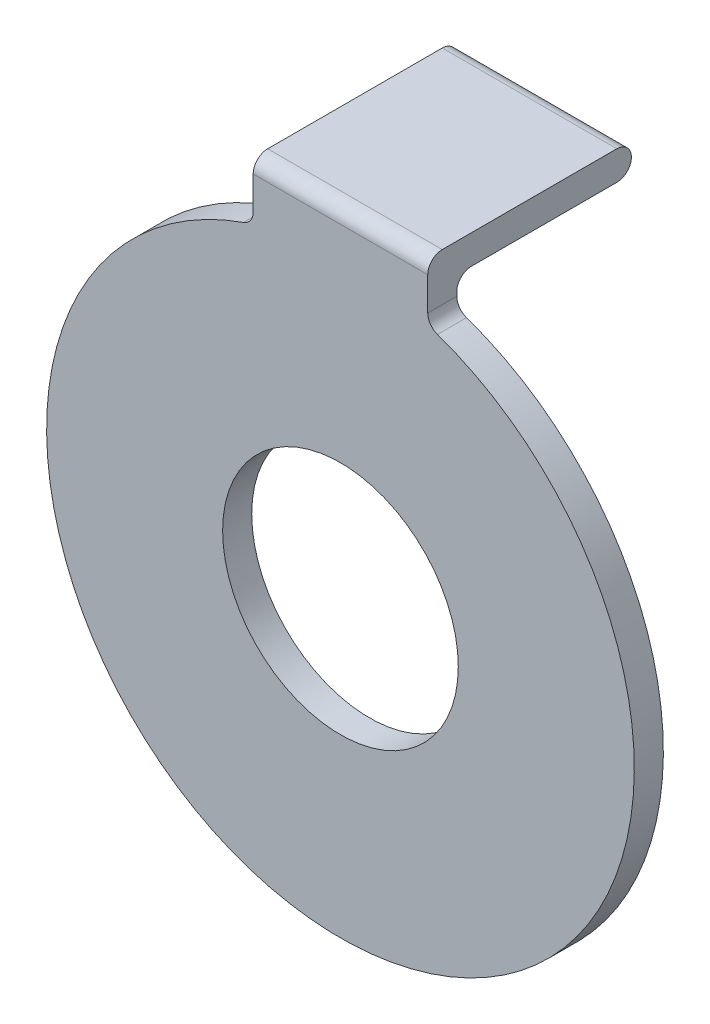
ISO-10303-21;
HEADER;
FILE_DESCRIPTION(('STEP AP214'),'2;1');
FILE_NAME('part.step','',(''),(''),'','','');
FILE_SCHEMA(('AUTOMOTIVE_DESIGN { 1 0 10303 214 1 1 1 1 }'));
ENDSEC;
DATA;
#1=APPLICATION_CONTEXT('core data for automotive mechanical design processes');
#2=APPLICATION_PROTOCOL_DEFINITION('international standard','automotive_design',2000,#1);
#3=PRODUCT_CONTEXT('',#1,'mechanical');
#4=PRODUCT('Part','Part','',(#3));
#5=PRODUCT_RELATED_PRODUCT_CATEGORY('part','',(#4));
#6=PRODUCT_DEFINITION_FORMATION('','',#4);
#7=PRODUCT_DEFINITION_CONTEXT('part definition',#1,'design');
#8=PRODUCT_DEFINITION('design','',#6,#7);
#9=PRODUCT_DEFINITION_SHAPE('','',#8);
#10=(LENGTH_UNIT() NAMED_UNIT(*) SI_UNIT(.MILLI.,.METRE.));
#11=(NAMED_UNIT(*) PLANE_ANGLE_UNIT() SI_UNIT($,.RADIAN.));
#12=(NAMED_UNIT(*) SI_UNIT($,.STERADIAN.) SOLID_ANGLE_UNIT());
#13=UNCERTAINTY_MEASURE_WITH_UNIT(LENGTH_MEASURE(1.E-05),#10,'distance_accuracy_value','');
#14=(GEOMETRIC_REPRESENTATION_CONTEXT(3) GLOBAL_UNCERTAINTY_ASSIGNED_CONTEXT((#13)) GLOBAL_UNIT_ASSIGNED_CONTEXT((#10,
#11,#12)) REPRESENTATION_CONTEXT('',''));
#15=CARTESIAN_POINT('',(0.,0.,0.));
#16=DIRECTION('',(0.,0.,1.));
#17=DIRECTION('',(1.,0.,0.));
#18=AXIS2_PLACEMENT_3D('',#15,#16,#17);
#19=CARTESIAN_POINT('',(0.,0.,0.));
#20=DIRECTION('',(0.,0.,1.));
#21=DIRECTION('',(1.,0.,0.));
#22=AXIS2_PLACEMENT_3D('',#19,#20,#21);
#23=PLANE('',#22);
#24=CARTESIAN_POINT('',(0.,0.,0.));
#25=DIRECTION('',(0.,0.,1.));
#26=DIRECTION('',(1.,0.,0.));
#27=AXIS2_PLACEMENT_3D('',#24,#25,#26);
#28=CIRCLE('',#27,4.05);
#29=CARTESIAN_POINT('',(4.05,0.,0.));
#30=VERTEX_POINT('',#29);
#31=EDGE_CURVE('E147',#30,#30,#28,.T.);
#32=ORIENTED_EDGE('',*,*,#31,.T.);
#33=EDGE_LOOP('',(#32));
#34=FACE_BOUND('',#33,.T.);
#35=DIRECTION('',(0.,-1.,0.));
#36=VECTOR('',#35,1.);
#37=CARTESIAN_POINT('',(-3.,0.,0.));
#38=LINE('',#37,#36);
#39=CARTESIAN_POINT('',(-3.,10.1441692229035,0.));
#40=VERTEX_POINT('',#39);
#41=CARTESIAN_POINT('',(-3.,10.0054984883313,0.));
#42=VERTEX_POINT('',#41);
#43=EDGE_CURVE('E149',#40,#42,#38,.T.);
#44=ORIENTED_EDGE('',*,*,#43,.F.);
#45=DIRECTION('',(-1.,0.,0.));
#46=VECTOR('',#45,1.);
#47=CARTESIAN_POINT('',(3.,10.1441692229035,0.));
#48=LINE('',#47,#46);
#49=CARTESIAN_POINT('',(3.,10.1441692229035,0.));
#50=VERTEX_POINT('',#49);
#51=EDGE_CURVE('E190',#40,#50,#48,.F.);
#52=ORIENTED_EDGE('',*,*,#51,.T.);
#53=DIRECTION('',(0.,-1.,0.));
#54=VECTOR('',#53,1.);
#55=CARTESIAN_POINT('',(3.,0.,0.));
#56=LINE('',#55,#54);
#57=CARTESIAN_POINT('',(3.,10.0054984883313,0.));
#58=VERTEX_POINT('',#57);
#59=EDGE_CURVE('E146',#50,#58,#56,.T.);
#60=ORIENTED_EDGE('',*,*,#59,.T.);
#61=CARTESIAN_POINT('',(3.5,10.0054984883313,0.));
#62=DIRECTION('',(0.,0.,1.));
#63=DIRECTION('',(1.,0.,0.));
#64=AXIS2_PLACEMENT_3D('',#61,#62,#63);
#65=CIRCLE('',#64,0.5);
#66=CARTESIAN_POINT('',(3.33490566037736,9.53354101246662,0.));
#67=VERTEX_POINT('',#66);
#68=EDGE_CURVE('E145',#58,#67,#65,.T.);
#69=ORIENTED_EDGE('',*,*,#68,.T.);
#70=CARTESIAN_POINT('',(0.,0.,0.));
#71=DIRECTION('',(0.,0.,1.));
#72=DIRECTION('',(1.,0.,0.));
#73=AXIS2_PLACEMENT_3D('',#70,#71,#72);
#74=CIRCLE('',#73,10.1);
#75=CARTESIAN_POINT('',(-3.33490566037736,9.53354101246662,0.));
#76=VERTEX_POINT('',#75);
#77=EDGE_CURVE('E138',#76,#67,#74,.T.);
#78=ORIENTED_EDGE('',*,*,#77,.F.);
#79=CARTESIAN_POINT('',(-3.5,10.0054984883313,0.));
#80=DIRECTION('',(0.,0.,1.));
#81=DIRECTION('',(1.,0.,0.));
#82=AXIS2_PLACEMENT_3D('',#79,#80,#81);
#83=CIRCLE('',#82,0.5);
#84=EDGE_CURVE('E121',#76,#42,#83,.T.);
#85=ORIENTED_EDGE('',*,*,#84,.T.);
#86=EDGE_LOOP('',(#44,#52,#60,#69,#78,#85));
#87=FACE_BOUND('',#86,.T.);
#88=ADVANCED_FACE('F36',(#34,#87),#23,.F.);
#89=CARTESIAN_POINT('',(0.,0.,1.));
#90=DIRECTION('',(0.,0.,-1.));
#91=DIRECTION('',(-1.,0.,0.));
#92=AXIS2_PLACEMENT_3D('',#89,#90,#91);
#93=CYLINDRICAL_SURFACE('',#92,10.1);
#94=CARTESIAN_POINT('',(0.,0.,1.));
#95=DIRECTION('',(0.,0.,1.));
#96=DIRECTION('',(1.,0.,0.));
#97=AXIS2_PLACEMENT_3D('',#94,#95,#96);
#98=CIRCLE('',#97,10.1);
#99=CARTESIAN_POINT('',(-3.33490566037736,9.53354101246662,1.));
#100=VERTEX_POINT('',#99);
#101=CARTESIAN_POINT('',(3.33490566037736,9.53354101246662,1.));
#102=VERTEX_POINT('',#101);
#103=EDGE_CURVE('E140',#100,#102,#98,.T.);
#104=ORIENTED_EDGE('',*,*,#103,.F.);
#105=DIRECTION('',(0.,0.,-1.));
#106=VECTOR('',#105,1.);
#107=CARTESIAN_POINT('',(-3.33490566037736,9.53354101246662,1.));
#108=LINE('',#107,#106);
#109=EDGE_CURVE('E125',#100,#76,#108,.T.);
#110=ORIENTED_EDGE('',*,*,#109,.T.);
#111=ORIENTED_EDGE('',*,*,#77,.T.);
#112=DIRECTION('',(0.,0.,-1.));
#113=VECTOR('',#112,1.);
#114=CARTESIAN_POINT('',(3.33490566037736,9.53354101246662,1.));
#115=LINE('',#114,#113);
#116=EDGE_CURVE('E142',#67,#102,#115,.F.);
#117=ORIENTED_EDGE('',*,*,#116,.T.);
#118=EDGE_LOOP('',(#104,#110,#111,#117));
#119=FACE_BOUND('',#118,.T.);
#120=ADVANCED_FACE('F137',(#119),#93,.T.);
#121=CARTESIAN_POINT('',(3.,0.,1.));
#122=DIRECTION('',(1.,0.,0.));
#123=DIRECTION('',(0.,0.,-1.));
#124=AXIS2_PLACEMENT_3D('',#121,#122,#123);
#125=PLANE('',#124);
#126=DIRECTION('',(0.,-1.,0.));
#127=VECTOR('',#126,1.);
#128=CARTESIAN_POINT('',(3.,0.,1.));
#129=LINE('',#128,#127);
#130=CARTESIAN_POINT('',(3.,11.1441692229035,1.));
#131=VERTEX_POINT('',#130);
#132=CARTESIAN_POINT('',(3.,10.0054984883313,1.));
#133=VERTEX_POINT('',#132);
#134=EDGE_CURVE('E221',#131,#133,#129,.T.);
#135=ORIENTED_EDGE('',*,*,#134,.T.);
#136=DIRECTION('',(0.,0.,-1.));
#137=VECTOR('',#136,1.);
#138=CARTESIAN_POINT('',(3.,10.0054984883313,1.));
#139=LINE('',#138,#137);
#140=EDGE_CURVE('E177',#133,#58,#139,.T.);
#141=ORIENTED_EDGE('',*,*,#140,.T.);
#142=ORIENTED_EDGE('',*,*,#59,.F.);
#143=CARTESIAN_POINT('',(3.,10.1441692229035,-0.5));
#144=DIRECTION('',(1.,0.,0.));
#145=DIRECTION('',(0.,0.,-1.));
#146=AXIS2_PLACEMENT_3D('',#143,#144,#145);
#147=CIRCLE('',#146,0.5);
#148=CARTESIAN_POINT('',(3.,10.6441692229035,-0.5));
#149=VERTEX_POINT('',#148);
#150=EDGE_CURVE('E11',#50,#149,#147,.F.);
#151=ORIENTED_EDGE('',*,*,#150,.T.);
#152=DIRECTION('',(0.,0.,1.));
#153=VECTOR('',#152,1.);
#154=CARTESIAN_POINT('',(3.,10.6441692229035,-6.));
#155=LINE('',#154,#153);
#156=CARTESIAN_POINT('',(3.,10.6441692229035,-5.5));
#157=VERTEX_POINT('',#156);
#158=EDGE_CURVE('E152',#157,#149,#155,.T.);
#159=ORIENTED_EDGE('',*,*,#158,.F.);
#160=CARTESIAN_POINT('',(3.,11.1441692229035,-5.5));
#161=DIRECTION('',(1.,0.,0.));
#162=DIRECTION('',(0.,0.,-1.));
#163=AXIS2_PLACEMENT_3D('',#160,#161,#162);
#164=CIRCLE('',#163,0.5);
#165=CARTESIAN_POINT('',(3.,11.1441692229035,-6.));
#166=VERTEX_POINT('',#165);
#167=EDGE_CURVE('E173',#157,#166,#164,.T.);
#168=ORIENTED_EDGE('',*,*,#167,.T.);
#169=CARTESIAN_POINT('',(3.,11.1441692229035,-5.5));
#170=DIRECTION('',(1.,0.,0.));
#171=DIRECTION('',(0.,0.,-1.));
#172=AXIS2_PLACEMENT_3D('',#169,#170,#171);
#173=CIRCLE('',#172,0.5);
#174=CARTESIAN_POINT('',(3.,11.6441692229035,-5.5));
#175=VERTEX_POINT('',#174);
#176=EDGE_CURVE('E175',#166,#175,#173,.T.);
#177=ORIENTED_EDGE('',*,*,#176,.T.);
#178=DIRECTION('',(0.,0.,-1.));
#179=VECTOR('',#178,1.);
#180=CARTESIAN_POINT('',(3.,11.6441692229035,1.));
#181=LINE('',#180,#179);
#182=CARTESIAN_POINT('',(3.,11.6441692229035,0.5));
#183=VERTEX_POINT('',#182);
#184=EDGE_CURVE('E161',#183,#175,#181,.T.);
#185=ORIENTED_EDGE('',*,*,#184,.F.);
#186=CARTESIAN_POINT('',(3.,11.1441692229035,0.5));
#187=DIRECTION('',(1.,0.,0.));
#188=DIRECTION('',(0.,0.,-1.));
#189=AXIS2_PLACEMENT_3D('',#186,#187,#188);
#190=CIRCLE('',#189,0.5);
#191=EDGE_CURVE('E59',#183,#131,#190,.T.);
#192=ORIENTED_EDGE('',*,*,#191,.T.);
#193=EDGE_LOOP('',(#135,#141,#142,#151,#159,#168,#177,#185,#192));
#194=FACE_BOUND('',#193,.T.);
#195=ADVANCED_FACE('F210',(#194),#125,.T.);
#196=CARTESIAN_POINT('',(0.,11.6441692229035,1.));
#197=DIRECTION('',(0.,-1.,0.));
#198=DIRECTION('',(0.,0.,-1.));
#199=AXIS2_PLACEMENT_3D('',#196,#197,#198);
#200=PLANE('',#199);
#201=ORIENTED_EDGE('',*,*,#184,.T.);
#202=DIRECTION('',(1.,0.,0.));
#203=VECTOR('',#202,1.);
#204=CARTESIAN_POINT('',(-3.,11.6441692229035,-5.5));
#205=LINE('',#204,#203);
#206=CARTESIAN_POINT('',(-3.,11.6441692229035,-5.5));
#207=VERTEX_POINT('',#206);
#208=EDGE_CURVE('E182',#175,#207,#205,.F.);
#209=ORIENTED_EDGE('',*,*,#208,.T.);
#210=DIRECTION('',(0.,0.,-1.));
#211=VECTOR('',#210,1.);
#212=CARTESIAN_POINT('',(-3.,11.6441692229035,1.));
#213=LINE('',#212,#211);
#214=CARTESIAN_POINT('',(-3.,11.6441692229035,0.5));
#215=VERTEX_POINT('',#214);
#216=EDGE_CURVE('E158',#215,#207,#213,.T.);
#217=ORIENTED_EDGE('',*,*,#216,.F.);
#218=DIRECTION('',(-1.,0.,0.));
#219=VECTOR('',#218,1.);
#220=CARTESIAN_POINT('',(3.,11.6441692229035,0.5));
#221=LINE('',#220,#219);
#222=EDGE_CURVE('E180',#215,#183,#221,.F.);
#223=ORIENTED_EDGE('',*,*,#222,.T.);
#224=EDGE_LOOP('',(#201,#209,#217,#223));
#225=FACE_BOUND('',#224,.T.);
#226=ADVANCED_FACE('F230',(#225),#200,.F.);
#227=CARTESIAN_POINT('',(0.,0.,1.));
#228=DIRECTION('',(0.,0.,-1.));
#229=DIRECTION('',(-1.,0.,0.));
#230=AXIS2_PLACEMENT_3D('',#227,#228,#229);
#231=CYLINDRICAL_SURFACE('',#230,4.05);
#232=CARTESIAN_POINT('',(0.,0.,1.));
#233=DIRECTION('',(0.,0.,1.));
#234=DIRECTION('',(1.,0.,0.));
#235=AXIS2_PLACEMENT_3D('',#232,#233,#234);
#236=CIRCLE('',#235,4.05);
#237=CARTESIAN_POINT('',(4.05,0.,1.));
#238=VERTEX_POINT('',#237);
#239=EDGE_CURVE('E157',#238,#238,#236,.T.);
#240=ORIENTED_EDGE('',*,*,#239,.T.);
#241=EDGE_LOOP('',(#240));
#242=FACE_BOUND('',#241,.T.);
#243=ORIENTED_EDGE('',*,*,#31,.F.);
#244=EDGE_LOOP('',(#243));
#245=FACE_BOUND('',#244,.T.);
#246=ADVANCED_FACE('F249',(#242,#245),#231,.F.);
#247=CARTESIAN_POINT('',(-3.,0.,1.));
#248=DIRECTION('',(1.,0.,0.));
#249=DIRECTION('',(0.,0.,-1.));
#250=AXIS2_PLACEMENT_3D('',#247,#248,#249);
#251=PLANE('',#250);
#252=ORIENTED_EDGE('',*,*,#43,.T.);
#253=DIRECTION('',(0.,0.,1.));
#254=VECTOR('',#253,1.);
#255=CARTESIAN_POINT('',(-3.,10.0054984883313,1.));
#256=LINE('',#255,#254);
#257=CARTESIAN_POINT('',(-3.,10.0054984883313,1.));
#258=VERTEX_POINT('',#257);
#259=EDGE_CURVE('E126',#42,#258,#256,.T.);
#260=ORIENTED_EDGE('',*,*,#259,.T.);
#261=DIRECTION('',(0.,-1.,0.));
#262=VECTOR('',#261,1.);
#263=CARTESIAN_POINT('',(-3.,0.,1.));
#264=LINE('',#263,#262);
#265=CARTESIAN_POINT('',(-3.,11.1441692229035,1.));
#266=VERTEX_POINT('',#265);
#267=EDGE_CURVE('E162',#266,#258,#264,.T.);
#268=ORIENTED_EDGE('',*,*,#267,.F.);
#269=CARTESIAN_POINT('',(-3.,11.1441692229035,0.5));
#270=DIRECTION('',(1.,0.,0.));
#271=DIRECTION('',(0.,0.,-1.));
#272=AXIS2_PLACEMENT_3D('',#269,#270,#271);
#273=CIRCLE('',#272,0.5);
#274=EDGE_CURVE('E141',#266,#215,#273,.F.);
#275=ORIENTED_EDGE('',*,*,#274,.T.);
#276=ORIENTED_EDGE('',*,*,#216,.T.);
#277=CARTESIAN_POINT('',(-3.,11.1441692229035,-5.5));
#278=DIRECTION('',(1.,0.,0.));
#279=DIRECTION('',(0.,0.,-1.));
#280=AXIS2_PLACEMENT_3D('',#277,#278,#279);
#281=CIRCLE('',#280,0.5);
#282=CARTESIAN_POINT('',(-3.,11.1441692229035,-6.));
#283=VERTEX_POINT('',#282);
#284=EDGE_CURVE('E169',#207,#283,#281,.F.);
#285=ORIENTED_EDGE('',*,*,#284,.T.);
#286=CARTESIAN_POINT('',(-3.,11.1441692229035,-5.5));
#287=DIRECTION('',(1.,0.,0.));
#288=DIRECTION('',(0.,0.,-1.));
#289=AXIS2_PLACEMENT_3D('',#286,#287,#288);
#290=CIRCLE('',#289,0.5);
#291=CARTESIAN_POINT('',(-3.,10.6441692229035,-5.5));
#292=VERTEX_POINT('',#291);
#293=EDGE_CURVE('E167',#283,#292,#290,.F.);
#294=ORIENTED_EDGE('',*,*,#293,.T.);
#295=DIRECTION('',(0.,0.,1.));
#296=VECTOR('',#295,1.);
#297=CARTESIAN_POINT('',(-3.,10.6441692229035,-6.));
#298=LINE('',#297,#296);
#299=CARTESIAN_POINT('',(-3.,10.6441692229035,-0.5));
#300=VERTEX_POINT('',#299);
#301=EDGE_CURVE('E201',#292,#300,#298,.T.);
#302=ORIENTED_EDGE('',*,*,#301,.T.);
#303=CARTESIAN_POINT('',(-3.,10.1441692229035,-0.5));
#304=DIRECTION('',(1.,0.,0.));
#305=DIRECTION('',(0.,0.,-1.));
#306=AXIS2_PLACEMENT_3D('',#303,#304,#305);
#307=CIRCLE('',#306,0.5);
#308=EDGE_CURVE('E45',#300,#40,#307,.T.);
#309=ORIENTED_EDGE('',*,*,#308,.T.);
#310=EDGE_LOOP('',(#252,#260,#268,#275,#276,#285,#294,#302,#309));
#311=FACE_BOUND('',#310,.T.);
#312=ADVANCED_FACE('F199',(#311),#251,.F.);
#313=CARTESIAN_POINT('',(0.,0.,1.));
#314=DIRECTION('',(0.,0.,1.));
#315=DIRECTION('',(1.,0.,0.));
#316=AXIS2_PLACEMENT_3D('',#313,#314,#315);
#317=PLANE('',#316);
#318=ORIENTED_EDGE('',*,*,#239,.F.);
#319=EDGE_LOOP('',(#318));
#320=FACE_BOUND('',#319,.T.);
#321=ORIENTED_EDGE('',*,*,#134,.F.);
#322=DIRECTION('',(-1.,0.,0.));
#323=VECTOR('',#322,1.);
#324=CARTESIAN_POINT('',(-3.,11.1441692229035,1.));
#325=LINE('',#324,#323);
#326=EDGE_CURVE('E132',#131,#266,#325,.T.);
#327=ORIENTED_EDGE('',*,*,#326,.T.);
#328=ORIENTED_EDGE('',*,*,#267,.T.);
#329=CARTESIAN_POINT('',(-3.5,10.0054984883313,1.));
#330=DIRECTION('',(0.,0.,1.));
#331=DIRECTION('',(1.,0.,0.));
#332=AXIS2_PLACEMENT_3D('',#329,#330,#331);
#333=CIRCLE('',#332,0.5);
#334=EDGE_CURVE('E131',#258,#100,#333,.F.);
#335=ORIENTED_EDGE('',*,*,#334,.T.);
#336=ORIENTED_EDGE('',*,*,#103,.T.);
#337=CARTESIAN_POINT('',(3.5,10.0054984883313,1.));
#338=DIRECTION('',(0.,0.,1.));
#339=DIRECTION('',(1.,0.,0.));
#340=AXIS2_PLACEMENT_3D('',#337,#338,#339);
#341=CIRCLE('',#340,0.5);
#342=EDGE_CURVE('E52',#102,#133,#341,.F.);
#343=ORIENTED_EDGE('',*,*,#342,.T.);
#344=EDGE_LOOP('',(#321,#327,#328,#335,#336,#343));
#345=FACE_BOUND('',#344,.T.);
#346=ADVANCED_FACE('F224',(#320,#345),#317,.T.);
#347=CARTESIAN_POINT('',(3.,10.6441692229035,-6.));
#348=DIRECTION('',(0.,1.,0.));
#349=DIRECTION('',(0.,0.,1.));
#350=AXIS2_PLACEMENT_3D('',#347,#348,#349);
#351=PLANE('',#350);
#352=ORIENTED_EDGE('',*,*,#301,.F.);
#353=DIRECTION('',(-1.,0.,0.));
#354=VECTOR('',#353,1.);
#355=CARTESIAN_POINT('',(3.,10.6441692229035,-5.5));
#356=LINE('',#355,#354);
#357=EDGE_CURVE('E188',#292,#157,#356,.F.);
#358=ORIENTED_EDGE('',*,*,#357,.T.);
#359=ORIENTED_EDGE('',*,*,#158,.T.);
#360=DIRECTION('',(-1.,0.,0.));
#361=VECTOR('',#360,1.);
#362=CARTESIAN_POINT('',(-3.,10.6441692229035,-0.5));
#363=LINE('',#362,#361);
#364=EDGE_CURVE('E185',#149,#300,#363,.T.);
#365=ORIENTED_EDGE('',*,*,#364,.T.);
#366=EDGE_LOOP('',(#352,#358,#359,#365));
#367=FACE_BOUND('',#366,.T.);
#368=ADVANCED_FACE('F213',(#367),#351,.F.);
#369=CARTESIAN_POINT('',(-3.5,10.0054984883313,1.));
#370=DIRECTION('',(0.,0.,-1.));
#371=DIRECTION('',(-1.,0.,0.));
#372=AXIS2_PLACEMENT_3D('',#369,#370,#371);
#373=CYLINDRICAL_SURFACE('',#372,0.5);
#374=ORIENTED_EDGE('',*,*,#334,.F.);
#375=ORIENTED_EDGE('',*,*,#259,.F.);
#376=ORIENTED_EDGE('',*,*,#84,.F.);
#377=ORIENTED_EDGE('',*,*,#109,.F.);
#378=EDGE_LOOP('',(#374,#375,#376,#377));
#379=FACE_BOUND('',#378,.T.);
#380=ADVANCED_FACE('F124',(#379),#373,.F.);
#381=CARTESIAN_POINT('',(3.5,10.0054984883313,1.));
#382=DIRECTION('',(0.,0.,-1.));
#383=DIRECTION('',(-1.,0.,0.));
#384=AXIS2_PLACEMENT_3D('',#381,#382,#383);
#385=CYLINDRICAL_SURFACE('',#384,0.5);
#386=ORIENTED_EDGE('',*,*,#342,.F.);
#387=ORIENTED_EDGE('',*,*,#116,.F.);
#388=ORIENTED_EDGE('',*,*,#68,.F.);
#389=ORIENTED_EDGE('',*,*,#140,.F.);
#390=EDGE_LOOP('',(#386,#387,#388,#389));
#391=FACE_BOUND('',#390,.T.);
#392=ADVANCED_FACE('F259',(#391),#385,.F.);
#393=CARTESIAN_POINT('',(0.,11.1441692229035,-5.5));
#394=DIRECTION('',(1.,0.,0.));
#395=DIRECTION('',(0.,0.,-1.));
#396=AXIS2_PLACEMENT_3D('',#393,#394,#395);
#397=CYLINDRICAL_SURFACE('',#396,0.5);
#398=ORIENTED_EDGE('',*,*,#357,.F.);
#399=ORIENTED_EDGE('',*,*,#293,.F.);
#400=DIRECTION('',(-1.,0.,0.));
#401=VECTOR('',#400,1.);
#402=CARTESIAN_POINT('',(-3.,11.1441692229035,-6.));
#403=LINE('',#402,#401);
#404=EDGE_CURVE('E40',#166,#283,#403,.T.);
#405=ORIENTED_EDGE('',*,*,#404,.F.);
#406=ORIENTED_EDGE('',*,*,#167,.F.);
#407=EDGE_LOOP('',(#398,#399,#405,#406));
#408=FACE_BOUND('',#407,.T.);
#409=ADVANCED_FACE('F262',(#408),#397,.T.);
#410=CARTESIAN_POINT('',(0.,11.1441692229035,-5.5));
#411=DIRECTION('',(-1.,0.,0.));
#412=DIRECTION('',(0.,0.,1.));
#413=AXIS2_PLACEMENT_3D('',#410,#411,#412);
#414=CYLINDRICAL_SURFACE('',#413,0.5);
#415=ORIENTED_EDGE('',*,*,#284,.F.);
#416=ORIENTED_EDGE('',*,*,#208,.F.);
#417=ORIENTED_EDGE('',*,*,#176,.F.);
#418=ORIENTED_EDGE('',*,*,#404,.T.);
#419=EDGE_LOOP('',(#415,#416,#417,#418));
#420=FACE_BOUND('',#419,.T.);
#421=ADVANCED_FACE('F236',(#420),#414,.T.);
#422=CARTESIAN_POINT('',(3.,10.1441692229035,-0.5));
#423=DIRECTION('',(1.,0.,0.));
#424=DIRECTION('',(0.,0.,-1.));
#425=AXIS2_PLACEMENT_3D('',#422,#423,#424);
#426=CYLINDRICAL_SURFACE('',#425,0.5);
#427=ORIENTED_EDGE('',*,*,#150,.F.);
#428=ORIENTED_EDGE('',*,*,#51,.F.);
#429=ORIENTED_EDGE('',*,*,#308,.F.);
#430=ORIENTED_EDGE('',*,*,#364,.F.);
#431=EDGE_LOOP('',(#427,#428,#429,#430));
#432=FACE_BOUND('',#431,.T.);
#433=ADVANCED_FACE('F207',(#432),#426,.F.);
#434=CARTESIAN_POINT('',(0.,11.1441692229035,0.5));
#435=DIRECTION('',(1.,0.,0.));
#436=DIRECTION('',(0.,0.,-1.));
#437=AXIS2_PLACEMENT_3D('',#434,#435,#436);
#438=CYLINDRICAL_SURFACE('',#437,0.5);
#439=ORIENTED_EDGE('',*,*,#191,.F.);
#440=ORIENTED_EDGE('',*,*,#222,.F.);
#441=ORIENTED_EDGE('',*,*,#274,.F.);
#442=ORIENTED_EDGE('',*,*,#326,.F.);
#443=EDGE_LOOP('',(#439,#440,#441,#442));
#444=FACE_BOUND('',#443,.T.);
#445=ADVANCED_FACE('F38',(#444),#438,.T.);
#446=CLOSED_SHELL('',(#88,#120,#195,#226,#246,#312,#346,#368,#380,#392,#409,#421,#433,#445));
#447=MANIFOLD_SOLID_BREP('B2',#446);
#448=ADVANCED_BREP_SHAPE_REPRESENTATION('',(#18,#447),#14);
#449=SHAPE_DEFINITION_REPRESENTATION(#9,#448);
ENDSEC;
END-ISO-10303-21;
